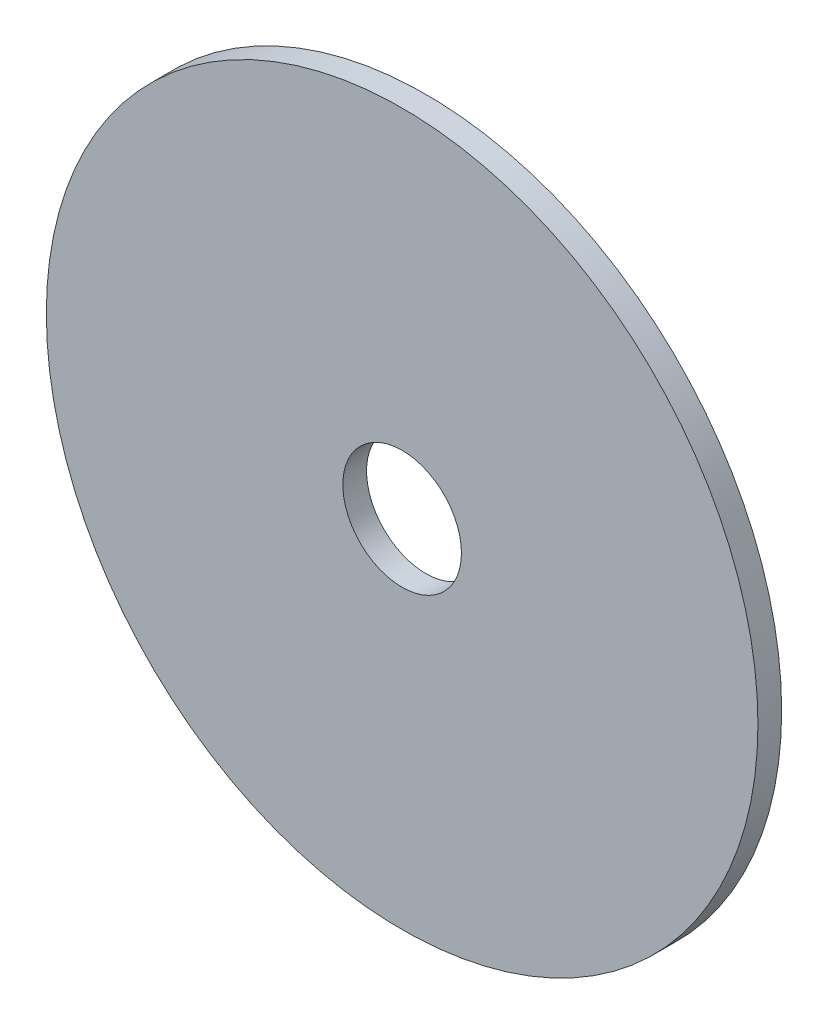
ISO-10303-21;
HEADER;
FILE_DESCRIPTION(('STEP AP214'),'2;1');
FILE_NAME('part.step','',(''),(''),'','','');
FILE_SCHEMA(('AUTOMOTIVE_DESIGN { 1 0 10303 214 1 1 1 1 }'));
ENDSEC;
DATA;
#1=APPLICATION_CONTEXT('core data for automotive mechanical design processes');
#2=APPLICATION_PROTOCOL_DEFINITION('international standard','automotive_design',2000,#1);
#3=PRODUCT_CONTEXT('',#1,'mechanical');
#4=PRODUCT('Part','Part','',(#3));
#5=PRODUCT_RELATED_PRODUCT_CATEGORY('part','',(#4));
#6=PRODUCT_DEFINITION_FORMATION('','',#4);
#7=PRODUCT_DEFINITION_CONTEXT('part definition',#1,'design');
#8=PRODUCT_DEFINITION('design','',#6,#7);
#9=PRODUCT_DEFINITION_SHAPE('','',#8);
#10=(LENGTH_UNIT() NAMED_UNIT(*) SI_UNIT(.MILLI.,.METRE.));
#11=(NAMED_UNIT(*) PLANE_ANGLE_UNIT() SI_UNIT($,.RADIAN.));
#12=(NAMED_UNIT(*) SI_UNIT($,.STERADIAN.) SOLID_ANGLE_UNIT());
#13=UNCERTAINTY_MEASURE_WITH_UNIT(LENGTH_MEASURE(1.E-05),#10,'distance_accuracy_value','');
#14=(GEOMETRIC_REPRESENTATION_CONTEXT(3) GLOBAL_UNCERTAINTY_ASSIGNED_CONTEXT((#13)) GLOBAL_UNIT_ASSIGNED_CONTEXT((#10,
#11,#12)) REPRESENTATION_CONTEXT('',''));
#15=CARTESIAN_POINT('',(0.,0.,0.));
#16=DIRECTION('',(0.,0.,1.));
#17=DIRECTION('',(1.,0.,0.));
#18=AXIS2_PLACEMENT_3D('',#15,#16,#17);
#19=CARTESIAN_POINT('',(0.,0.,2.));
#20=DIRECTION('',(0.,0.,-1.));
#21=DIRECTION('',(-1.,0.,0.));
#22=AXIS2_PLACEMENT_3D('',#19,#20,#21);
#23=CYLINDRICAL_SURFACE('',#22,30.);
#24=CARTESIAN_POINT('',(0.,0.,2.));
#25=DIRECTION('',(0.,0.,1.));
#26=DIRECTION('',(1.,0.,0.));
#27=AXIS2_PLACEMENT_3D('',#24,#25,#26);
#28=CIRCLE('',#27,30.);
#29=CARTESIAN_POINT('',(30.,0.,2.));
#30=VERTEX_POINT('',#29);
#31=EDGE_CURVE('E10',#30,#30,#28,.T.);
#32=ORIENTED_EDGE('',*,*,#31,.F.);
#33=EDGE_LOOP('',(#32));
#34=FACE_BOUND('',#33,.T.);
#35=CARTESIAN_POINT('',(0.,0.,0.));
#36=DIRECTION('',(0.,0.,1.));
#37=DIRECTION('',(1.,0.,0.));
#38=AXIS2_PLACEMENT_3D('',#35,#36,#37);
#39=CIRCLE('',#38,30.);
#40=CARTESIAN_POINT('',(30.,0.,0.));
#41=VERTEX_POINT('',#40);
#42=EDGE_CURVE('E40',#41,#41,#39,.T.);
#43=ORIENTED_EDGE('',*,*,#42,.T.);
#44=EDGE_LOOP('',(#43));
#45=FACE_BOUND('',#44,.T.);
#46=ADVANCED_FACE('F33',(#34,#45),#23,.T.);
#47=CARTESIAN_POINT('',(0.,0.,2.));
#48=DIRECTION('',(0.,0.,1.));
#49=DIRECTION('',(1.,0.,0.));
#50=AXIS2_PLACEMENT_3D('',#47,#48,#49);
#51=PLANE('',#50);
#52=CARTESIAN_POINT('',(0.,0.,2.));
#53=DIRECTION('',(0.,0.,1.));
#54=DIRECTION('',(1.,0.,0.));
#55=AXIS2_PLACEMENT_3D('',#52,#53,#54);
#56=CIRCLE('',#55,5.);
#57=CARTESIAN_POINT('',(5.,0.,2.));
#58=VERTEX_POINT('',#57);
#59=EDGE_CURVE('E46',#58,#58,#56,.T.);
#60=ORIENTED_EDGE('',*,*,#59,.F.);
#61=EDGE_LOOP('',(#60));
#62=FACE_BOUND('',#61,.T.);
#63=ORIENTED_EDGE('',*,*,#31,.T.);
#64=EDGE_LOOP('',(#63));
#65=FACE_BOUND('',#64,.T.);
#66=ADVANCED_FACE('F62',(#62,#65),#51,.T.);
#67=CARTESIAN_POINT('',(0.,0.,0.));
#68=DIRECTION('',(0.,0.,1.));
#69=DIRECTION('',(1.,0.,0.));
#70=AXIS2_PLACEMENT_3D('',#67,#68,#69);
#71=PLANE('',#70);
#72=CARTESIAN_POINT('',(0.,0.,0.));
#73=DIRECTION('',(0.,0.,1.));
#74=DIRECTION('',(1.,0.,0.));
#75=AXIS2_PLACEMENT_3D('',#72,#73,#74);
#76=CIRCLE('',#75,5.);
#77=CARTESIAN_POINT('',(5.,0.,0.));
#78=VERTEX_POINT('',#77);
#79=EDGE_CURVE('E36',#78,#78,#76,.T.);
#80=ORIENTED_EDGE('',*,*,#79,.T.);
#81=EDGE_LOOP('',(#80));
#82=FACE_BOUND('',#81,.T.);
#83=ORIENTED_EDGE('',*,*,#42,.F.);
#84=EDGE_LOOP('',(#83));
#85=FACE_BOUND('',#84,.T.);
#86=ADVANCED_FACE('F53',(#82,#85),#71,.F.);
#87=CARTESIAN_POINT('',(0.,0.,-2.));
#88=DIRECTION('',(0.,0.,1.));
#89=DIRECTION('',(1.,0.,0.));
#90=AXIS2_PLACEMENT_3D('',#87,#88,#89);
#91=CYLINDRICAL_SURFACE('',#90,5.);
#92=ORIENTED_EDGE('',*,*,#59,.T.);
#93=EDGE_LOOP('',(#92));
#94=FACE_BOUND('',#93,.T.);
#95=ORIENTED_EDGE('',*,*,#79,.F.);
#96=EDGE_LOOP('',(#95));
#97=FACE_BOUND('',#96,.T.);
#98=ADVANCED_FACE('F56',(#94,#97),#91,.F.);
#99=CLOSED_SHELL('',(#46,#66,#86,#98));
#100=MANIFOLD_SOLID_BREP('B2',#99);
#101=ADVANCED_BREP_SHAPE_REPRESENTATION('',(#18,#100),#14);
#102=SHAPE_DEFINITION_REPRESENTATION(#9,#101);
ENDSEC;
END-ISO-10303-21;
